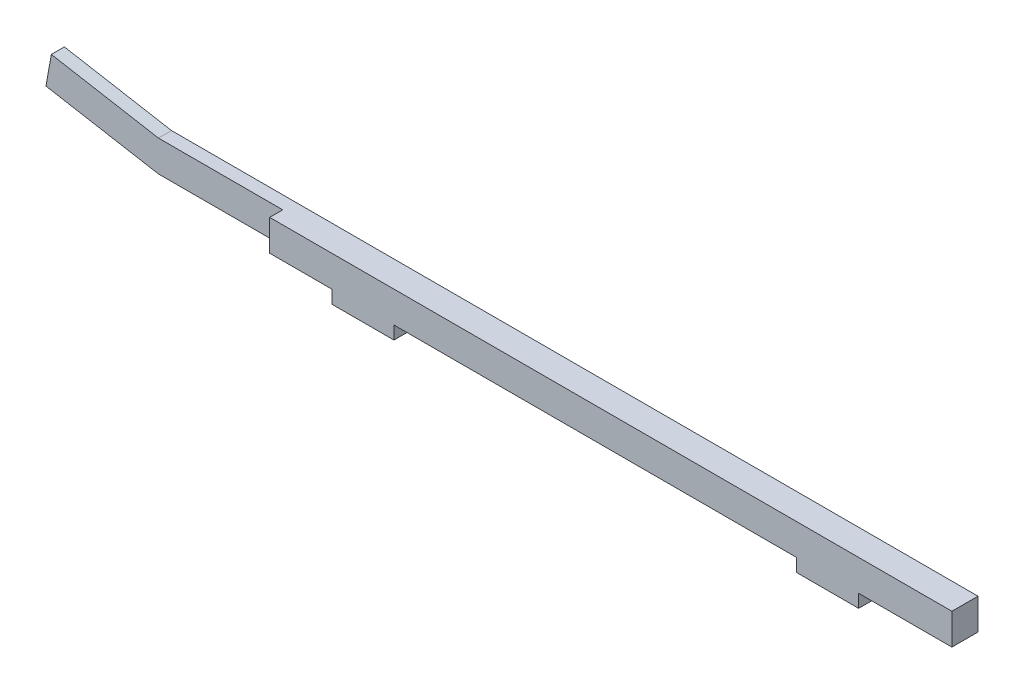
ISO-10303-21;
HEADER;
FILE_DESCRIPTION(('STEP AP214'),'2;1');
FILE_NAME('part.step','',(''),(''),'','','');
FILE_SCHEMA(('AUTOMOTIVE_DESIGN { 1 0 10303 214 1 1 1 1 }'));
ENDSEC;
DATA;
#1=APPLICATION_CONTEXT('core data for automotive mechanical design processes');
#2=APPLICATION_PROTOCOL_DEFINITION('international standard','automotive_design',2000,#1);
#3=PRODUCT_CONTEXT('',#1,'mechanical');
#4=PRODUCT('Part','Part','',(#3));
#5=PRODUCT_RELATED_PRODUCT_CATEGORY('part','',(#4));
#6=PRODUCT_DEFINITION_FORMATION('','',#4);
#7=PRODUCT_DEFINITION_CONTEXT('part definition',#1,'design');
#8=PRODUCT_DEFINITION('design','',#6,#7);
#9=PRODUCT_DEFINITION_SHAPE('','',#8);
#10=(LENGTH_UNIT() NAMED_UNIT(*) SI_UNIT(.MILLI.,.METRE.));
#11=(NAMED_UNIT(*) PLANE_ANGLE_UNIT() SI_UNIT($,.RADIAN.));
#12=(NAMED_UNIT(*) SI_UNIT($,.STERADIAN.) SOLID_ANGLE_UNIT());
#13=UNCERTAINTY_MEASURE_WITH_UNIT(LENGTH_MEASURE(1.E-05),#10,'distance_accuracy_value','');
#14=(GEOMETRIC_REPRESENTATION_CONTEXT(3) GLOBAL_UNCERTAINTY_ASSIGNED_CONTEXT((#13)) GLOBAL_UNIT_ASSIGNED_CONTEXT((#10,
#11,#12)) REPRESENTATION_CONTEXT('',''));
#15=CARTESIAN_POINT('',(0.,0.,0.));
#16=DIRECTION('',(0.,0.,1.));
#17=DIRECTION('',(1.,0.,0.));
#18=AXIS2_PLACEMENT_3D('',#15,#16,#17);
#19=CARTESIAN_POINT('',(0.,5.334,0.));
#20=DIRECTION('',(0.,1.,0.));
#21=DIRECTION('',(0.,0.,1.));
#22=AXIS2_PLACEMENT_3D('',#19,#20,#21);
#23=PLANE('',#22);
#24=DIRECTION('',(0.,0.,1.));
#25=VECTOR('',#24,1.);
#26=CARTESIAN_POINT('',(291.517035207962,5.334,0.));
#27=LINE('',#26,#25);
#28=CARTESIAN_POINT('',(291.517035207962,5.334,54.6115268567689));
#29=VERTEX_POINT('',#28);
#30=CARTESIAN_POINT('',(291.517035207962,5.334,65.2795268567689));
#31=VERTEX_POINT('',#30);
#32=EDGE_CURVE('E225',#29,#31,#27,.T.);
#33=ORIENTED_EDGE('',*,*,#32,.F.);
#34=DIRECTION('',(-1.,0.,0.));
#35=VECTOR('',#34,1.);
#36=CARTESIAN_POINT('',(0.,5.334,54.6115268567689));
#37=LINE('',#36,#35);
#38=CARTESIAN_POINT('',(329.617035207962,5.334,54.6115268567689));
#39=VERTEX_POINT('',#38);
#40=EDGE_CURVE('E198',#39,#29,#37,.T.);
#41=ORIENTED_EDGE('',*,*,#40,.F.);
#42=DIRECTION('',(0.,0.,1.));
#43=VECTOR('',#42,1.);
#44=CARTESIAN_POINT('',(329.617035207962,5.334,54.6115268567689));
#45=LINE('',#44,#43);
#46=CARTESIAN_POINT('',(329.617035207962,5.334,65.2795268567689));
#47=VERTEX_POINT('',#46);
#48=EDGE_CURVE('E237',#39,#47,#45,.T.);
#49=ORIENTED_EDGE('',*,*,#48,.T.);
#50=DIRECTION('',(-1.,0.,0.));
#51=VECTOR('',#50,1.);
#52=CARTESIAN_POINT('',(0.,5.334,65.2795268567689));
#53=LINE('',#52,#51);
#54=EDGE_CURVE('E86',#47,#31,#53,.T.);
#55=ORIENTED_EDGE('',*,*,#54,.T.);
#56=EDGE_LOOP('',(#33,#41,#49,#55));
#57=FACE_BOUND('',#56,.T.);
#58=ADVANCED_FACE('F61',(#57),#23,.F.);
#59=DIRECTION('',(0.,0.,-1.));
#60=VECTOR('',#59,1.);
#61=CARTESIAN_POINT('',(266.117035207962,5.334,1.38474531183382E-12));
#62=LINE('',#61,#60);
#63=CARTESIAN_POINT('',(266.117035207962,5.334,65.2795268567689));
#64=VERTEX_POINT('',#63);
#65=CARTESIAN_POINT('',(266.117035207962,5.334,54.6115268567689));
#66=VERTEX_POINT('',#65);
#67=EDGE_CURVE('E78',#64,#66,#62,.T.);
#68=ORIENTED_EDGE('',*,*,#67,.F.);
#69=CARTESIAN_POINT('',(101.599999999999,5.334,65.2795268567689));
#70=VERTEX_POINT('',#69);
#71=EDGE_CURVE('E256',#64,#70,#53,.T.);
#72=ORIENTED_EDGE('',*,*,#71,.T.);
#73=DIRECTION('',(0.,0.,1.));
#74=VECTOR('',#73,1.);
#75=CARTESIAN_POINT('',(101.599999999999,5.334,0.));
#76=LINE('',#75,#74);
#77=CARTESIAN_POINT('',(101.599999999999,5.334,54.6115268567689));
#78=VERTEX_POINT('',#77);
#79=EDGE_CURVE('E275',#78,#70,#76,.T.);
#80=ORIENTED_EDGE('',*,*,#79,.F.);
#81=EDGE_CURVE('E259',#66,#78,#37,.T.);
#82=ORIENTED_EDGE('',*,*,#81,.F.);
#83=EDGE_LOOP('',(#68,#72,#80,#82));
#84=FACE_BOUND('',#83,.T.);
#85=ADVANCED_FACE('F303',(#84),#23,.F.);
#86=CARTESIAN_POINT('',(0.,0.,54.6115268567689));
#87=DIRECTION('',(0.,0.,1.));
#88=DIRECTION('',(1.,0.,0.));
#89=AXIS2_PLACEMENT_3D('',#86,#87,#88);
#90=PLANE('',#89);
#91=DIRECTION('',(0.,1.,0.));
#92=VECTOR('',#91,1.);
#93=CARTESIAN_POINT('',(76.1999999999993,0.,54.6115268567689));
#94=LINE('',#93,#92);
#95=CARTESIAN_POINT('',(76.1999999999993,0.,54.6115268567689));
#96=VERTEX_POINT('',#95);
#97=CARTESIAN_POINT('',(76.1999999999993,5.334,54.6115268567689));
#98=VERTEX_POINT('',#97);
#99=EDGE_CURVE('E65',#96,#98,#94,.T.);
#100=ORIENTED_EDGE('',*,*,#99,.T.);
#101=CARTESIAN_POINT('',(0.,5.334,54.6115268567689));
#102=VERTEX_POINT('',#101);
#103=EDGE_CURVE('E255',#98,#102,#37,.T.);
#104=ORIENTED_EDGE('',*,*,#103,.T.);
#105=DIRECTION('',(-0.984807753012208,0.173648177666931,0.));
#106=VECTOR('',#105,1.);
#107=CARTESIAN_POINT('',(0.912167722249563,5.17316021963601,54.6115268567689));
#108=LINE('',#107,#106);
#109=CARTESIAN_POINT('',(-45.9465325315106,13.4356133553046,54.6115268567689));
#110=VERTEX_POINT('',#109);
#111=EDGE_CURVE('E196',#102,#110,#108,.T.);
#112=ORIENTED_EDGE('',*,*,#111,.T.);
#113=DIRECTION('',(0.173648177666931,0.984807753012208,0.));
#114=VECTOR('',#113,1.);
#115=CARTESIAN_POINT('',(-46.8587002537602,8.26245313566857,54.6115268567689));
#116=LINE('',#115,#114);
#117=CARTESIAN_POINT('',(-43.7747046213926,25.7526614972951,54.6115268567689));
#118=VERTEX_POINT('',#117);
#119=EDGE_CURVE('E207',#110,#118,#116,.T.);
#120=ORIENTED_EDGE('',*,*,#119,.T.);
#121=DIRECTION('',(-0.984807753012208,0.173648177666931,0.));
#122=VECTOR('',#121,1.);
#123=CARTESIAN_POINT('',(3.08399563236757,17.4902083616265,54.6115268567689));
#124=LINE('',#123,#122);
#125=CARTESIAN_POINT('',(0.,18.034,54.6115268567689));
#126=VERTEX_POINT('',#125);
#127=EDGE_CURVE('E211',#126,#118,#124,.T.);
#128=ORIENTED_EDGE('',*,*,#127,.F.);
#129=DIRECTION('',(-1.,0.,0.));
#130=VECTOR('',#129,1.);
#131=CARTESIAN_POINT('',(0.,18.034,54.6115268567689));
#132=LINE('',#131,#130);
#133=CARTESIAN_POINT('',(329.617035207962,18.034,54.6115268567689));
#134=VERTEX_POINT('',#133);
#135=EDGE_CURVE('E248',#134,#126,#132,.T.);
#136=ORIENTED_EDGE('',*,*,#135,.F.);
#137=DIRECTION('',(0.,-1.,0.));
#138=VECTOR('',#137,1.);
#139=CARTESIAN_POINT('',(329.617035207962,18.034,54.6115268567689));
#140=LINE('',#139,#138);
#141=EDGE_CURVE('E266',#134,#39,#140,.T.);
#142=ORIENTED_EDGE('',*,*,#141,.T.);
#143=ORIENTED_EDGE('',*,*,#40,.T.);
#144=DIRECTION('',(0.,1.,0.));
#145=VECTOR('',#144,1.);
#146=CARTESIAN_POINT('',(291.517035207962,0.,54.6115268567689));
#147=LINE('',#146,#145);
#148=CARTESIAN_POINT('',(291.517035207962,0.,54.6115268567689));
#149=VERTEX_POINT('',#148);
#150=EDGE_CURVE('E234',#149,#29,#147,.T.);
#151=ORIENTED_EDGE('',*,*,#150,.F.);
#152=DIRECTION('',(1.,0.,0.));
#153=VECTOR('',#152,1.);
#154=CARTESIAN_POINT('',(0.,0.,54.6115268567689));
#155=LINE('',#154,#153);
#156=CARTESIAN_POINT('',(266.117035207962,0.,54.6115268567689));
#157=VERTEX_POINT('',#156);
#158=EDGE_CURVE('E221',#157,#149,#155,.T.);
#159=ORIENTED_EDGE('',*,*,#158,.F.);
#160=DIRECTION('',(0.,1.,0.));
#161=VECTOR('',#160,1.);
#162=CARTESIAN_POINT('',(266.117035207962,0.,54.6115268567689));
#163=LINE('',#162,#161);
#164=EDGE_CURVE('E231',#157,#66,#163,.T.);
#165=ORIENTED_EDGE('',*,*,#164,.T.);
#166=ORIENTED_EDGE('',*,*,#81,.T.);
#167=DIRECTION('',(0.,1.,0.));
#168=VECTOR('',#167,1.);
#169=CARTESIAN_POINT('',(101.599999999999,0.,54.6115268567689));
#170=LINE('',#169,#168);
#171=CARTESIAN_POINT('',(101.599999999999,0.,54.6115268567689));
#172=VERTEX_POINT('',#171);
#173=EDGE_CURVE('E12',#172,#78,#170,.T.);
#174=ORIENTED_EDGE('',*,*,#173,.F.);
#175=DIRECTION('',(1.,0.,0.));
#176=VECTOR('',#175,1.);
#177=CARTESIAN_POINT('',(0.,0.,54.6115268567689));
#178=LINE('',#177,#176);
#179=EDGE_CURVE('E271',#96,#172,#178,.T.);
#180=ORIENTED_EDGE('',*,*,#179,.F.);
#181=EDGE_LOOP('',(#100,#104,#112,#120,#128,#136,#142,#143,#151,#159,#165,#166,#174,#180));
#182=FACE_BOUND('',#181,.T.);
#183=ADVANCED_FACE('F63',(#182),#90,.F.);
#184=CARTESIAN_POINT('',(101.599999999999,0.,0.));
#185=DIRECTION('',(-1.,0.,0.));
#186=DIRECTION('',(0.,0.,1.));
#187=AXIS2_PLACEMENT_3D('',#184,#185,#186);
#188=PLANE('',#187);
#189=ORIENTED_EDGE('',*,*,#79,.T.);
#190=DIRECTION('',(0.,1.,0.));
#191=VECTOR('',#190,1.);
#192=CARTESIAN_POINT('',(101.599999999999,0.,65.2795268567689));
#193=LINE('',#192,#191);
#194=CARTESIAN_POINT('',(101.599999999999,0.,65.2795268567689));
#195=VERTEX_POINT('',#194);
#196=EDGE_CURVE('E70',#195,#70,#193,.T.);
#197=ORIENTED_EDGE('',*,*,#196,.F.);
#198=DIRECTION('',(0.,0.,1.));
#199=VECTOR('',#198,1.);
#200=CARTESIAN_POINT('',(101.599999999999,0.,0.));
#201=LINE('',#200,#199);
#202=EDGE_CURVE('E279',#172,#195,#201,.T.);
#203=ORIENTED_EDGE('',*,*,#202,.F.);
#204=ORIENTED_EDGE('',*,*,#173,.T.);
#205=EDGE_LOOP('',(#189,#197,#203,#204));
#206=FACE_BOUND('',#205,.T.);
#207=ADVANCED_FACE('F307',(#206),#188,.F.);
#208=CARTESIAN_POINT('',(0.,0.,65.2795268567689));
#209=DIRECTION('',(0.,0.,-1.));
#210=DIRECTION('',(-1.,0.,0.));
#211=AXIS2_PLACEMENT_3D('',#208,#209,#210);
#212=PLANE('',#211);
#213=DIRECTION('',(-1.,0.,0.));
#214=VECTOR('',#213,1.);
#215=CARTESIAN_POINT('',(0.,18.034,65.2795268567689));
#216=LINE('',#215,#214);
#217=CARTESIAN_POINT('',(329.617035207962,18.034,65.2795268567689));
#218=VERTEX_POINT('',#217);
#219=CARTESIAN_POINT('',(50.8,18.034,65.2795268567689));
#220=VERTEX_POINT('',#219);
#221=EDGE_CURVE('E197',#218,#220,#216,.T.);
#222=ORIENTED_EDGE('',*,*,#221,.T.);
#223=DIRECTION('',(0.,1.,0.));
#224=VECTOR('',#223,1.);
#225=CARTESIAN_POINT('',(50.8,18.034,65.2795268567689));
#226=LINE('',#225,#224);
#227=CARTESIAN_POINT('',(50.8,5.334,65.2795268567689));
#228=VERTEX_POINT('',#227);
#229=EDGE_CURVE('E188',#228,#220,#226,.T.);
#230=ORIENTED_EDGE('',*,*,#229,.F.);
#231=CARTESIAN_POINT('',(76.1999999999993,5.334,65.2795268567689));
#232=VERTEX_POINT('',#231);
#233=EDGE_CURVE('E257',#232,#228,#53,.T.);
#234=ORIENTED_EDGE('',*,*,#233,.F.);
#235=DIRECTION('',(0.,1.,0.));
#236=VECTOR('',#235,1.);
#237=CARTESIAN_POINT('',(76.1999999999993,0.,65.2795268567689));
#238=LINE('',#237,#236);
#239=CARTESIAN_POINT('',(76.1999999999993,0.,65.2795268567689));
#240=VERTEX_POINT('',#239);
#241=EDGE_CURVE('E286',#240,#232,#238,.T.);
#242=ORIENTED_EDGE('',*,*,#241,.F.);
#243=DIRECTION('',(-1.,0.,0.));
#244=VECTOR('',#243,1.);
#245=CARTESIAN_POINT('',(0.,0.,65.2795268567689));
#246=LINE('',#245,#244);
#247=EDGE_CURVE('E277',#195,#240,#246,.T.);
#248=ORIENTED_EDGE('',*,*,#247,.F.);
#249=ORIENTED_EDGE('',*,*,#196,.T.);
#250=ORIENTED_EDGE('',*,*,#71,.F.);
#251=DIRECTION('',(0.,1.,0.));
#252=VECTOR('',#251,1.);
#253=CARTESIAN_POINT('',(266.117035207962,0.,65.2795268567689));
#254=LINE('',#253,#252);
#255=CARTESIAN_POINT('',(266.117035207962,0.,65.2795268567689));
#256=VERTEX_POINT('',#255);
#257=EDGE_CURVE('E241',#256,#64,#254,.T.);
#258=ORIENTED_EDGE('',*,*,#257,.F.);
#259=DIRECTION('',(-1.,0.,0.));
#260=VECTOR('',#259,1.);
#261=CARTESIAN_POINT('',(0.,0.,65.2795268567689));
#262=LINE('',#261,#260);
#263=CARTESIAN_POINT('',(291.517035207962,0.,65.2795268567689));
#264=VERTEX_POINT('',#263);
#265=EDGE_CURVE('E227',#264,#256,#262,.T.);
#266=ORIENTED_EDGE('',*,*,#265,.F.);
#267=DIRECTION('',(0.,1.,0.));
#268=VECTOR('',#267,1.);
#269=CARTESIAN_POINT('',(291.517035207962,0.,65.2795268567689));
#270=LINE('',#269,#268);
#271=EDGE_CURVE('E238',#264,#31,#270,.T.);
#272=ORIENTED_EDGE('',*,*,#271,.T.);
#273=ORIENTED_EDGE('',*,*,#54,.F.);
#274=DIRECTION('',(0.,-1.,0.));
#275=VECTOR('',#274,1.);
#276=CARTESIAN_POINT('',(329.617035207962,18.034,65.2795268567689));
#277=LINE('',#276,#275);
#278=EDGE_CURVE('E264',#218,#47,#277,.T.);
#279=ORIENTED_EDGE('',*,*,#278,.F.);
#280=EDGE_LOOP('',(#222,#230,#234,#242,#248,#249,#250,#258,#266,#272,#273,#279));
#281=FACE_BOUND('',#280,.T.);
#282=ADVANCED_FACE('F300',(#281),#212,.F.);
#283=CARTESIAN_POINT('',(76.1999999999994,0.,0.));
#284=DIRECTION('',(1.,0.,0.));
#285=DIRECTION('',(0.,0.,-1.));
#286=AXIS2_PLACEMENT_3D('',#283,#284,#285);
#287=PLANE('',#286);
#288=DIRECTION('',(0.,0.,-1.));
#289=VECTOR('',#288,1.);
#290=CARTESIAN_POINT('',(76.1999999999994,5.334,0.));
#291=LINE('',#290,#289);
#292=EDGE_CURVE('E253',#232,#98,#291,.T.);
#293=ORIENTED_EDGE('',*,*,#292,.T.);
#294=ORIENTED_EDGE('',*,*,#99,.F.);
#295=DIRECTION('',(0.,0.,-1.));
#296=VECTOR('',#295,1.);
#297=CARTESIAN_POINT('',(76.1999999999994,0.,0.));
#298=LINE('',#297,#296);
#299=EDGE_CURVE('E274',#240,#96,#298,.T.);
#300=ORIENTED_EDGE('',*,*,#299,.F.);
#301=ORIENTED_EDGE('',*,*,#241,.T.);
#302=EDGE_LOOP('',(#293,#294,#300,#301));
#303=FACE_BOUND('',#302,.T.);
#304=ADVANCED_FACE('F296',(#303),#287,.F.);
#305=CARTESIAN_POINT('',(0.,0.,0.));
#306=DIRECTION('',(0.,1.,0.));
#307=DIRECTION('',(0.,0.,1.));
#308=AXIS2_PLACEMENT_3D('',#305,#306,#307);
#309=PLANE('',#308);
#310=ORIENTED_EDGE('',*,*,#179,.T.);
#311=ORIENTED_EDGE('',*,*,#202,.T.);
#312=ORIENTED_EDGE('',*,*,#247,.T.);
#313=ORIENTED_EDGE('',*,*,#299,.T.);
#314=EDGE_LOOP('',(#310,#311,#312,#313));
#315=FACE_BOUND('',#314,.T.);
#316=ADVANCED_FACE('F309',(#315),#309,.F.);
#317=ORIENTED_EDGE('',*,*,#233,.T.);
#318=DIRECTION('',(0.,0.,1.));
#319=VECTOR('',#318,1.);
#320=CARTESIAN_POINT('',(50.8,5.334,59.9455268567689));
#321=LINE('',#320,#319);
#322=CARTESIAN_POINT('',(50.8,5.334,59.9455268567689));
#323=VERTEX_POINT('',#322);
#324=EDGE_CURVE('E183',#323,#228,#321,.T.);
#325=ORIENTED_EDGE('',*,*,#324,.F.);
#326=DIRECTION('',(1.,0.,0.));
#327=VECTOR('',#326,1.);
#328=CARTESIAN_POINT('',(0.,5.334,59.9455268567689));
#329=LINE('',#328,#327);
#330=CARTESIAN_POINT('',(0.,5.334,59.9455268567689));
#331=VERTEX_POINT('',#330);
#332=EDGE_CURVE('E177',#331,#323,#329,.T.);
#333=ORIENTED_EDGE('',*,*,#332,.F.);
#334=DIRECTION('',(0.,0.,1.));
#335=VECTOR('',#334,1.);
#336=CARTESIAN_POINT('',(0.,5.334,0.));
#337=LINE('',#336,#335);
#338=EDGE_CURVE('E181',#102,#331,#337,.T.);
#339=ORIENTED_EDGE('',*,*,#338,.F.);
#340=ORIENTED_EDGE('',*,*,#103,.F.);
#341=ORIENTED_EDGE('',*,*,#292,.F.);
#342=EDGE_LOOP('',(#317,#325,#333,#339,#340,#341));
#343=FACE_BOUND('',#342,.T.);
#344=ADVANCED_FACE('F180',(#343),#23,.F.);
#345=CARTESIAN_POINT('',(0.,18.034,0.));
#346=DIRECTION('',(0.,1.,0.));
#347=DIRECTION('',(0.,0.,1.));
#348=AXIS2_PLACEMENT_3D('',#345,#346,#347);
#349=PLANE('',#348);
#350=DIRECTION('',(0.,0.,1.));
#351=VECTOR('',#350,1.);
#352=CARTESIAN_POINT('',(50.8,18.034,59.9455268567689));
#353=LINE('',#352,#351);
#354=CARTESIAN_POINT('',(50.8,18.034,59.9455268567689));
#355=VERTEX_POINT('',#354);
#356=EDGE_CURVE('E214',#355,#220,#353,.T.);
#357=ORIENTED_EDGE('',*,*,#356,.T.);
#358=ORIENTED_EDGE('',*,*,#221,.F.);
#359=DIRECTION('',(0.,0.,1.));
#360=VECTOR('',#359,1.);
#361=CARTESIAN_POINT('',(329.617035207962,18.034,54.6115268567689));
#362=LINE('',#361,#360);
#363=EDGE_CURVE('E261',#134,#218,#362,.T.);
#364=ORIENTED_EDGE('',*,*,#363,.F.);
#365=ORIENTED_EDGE('',*,*,#135,.T.);
#366=DIRECTION('',(0.,0.,1.));
#367=VECTOR('',#366,1.);
#368=CARTESIAN_POINT('',(0.,18.034,0.));
#369=LINE('',#368,#367);
#370=CARTESIAN_POINT('',(0.,18.034,59.9455268567689));
#371=VERTEX_POINT('',#370);
#372=EDGE_CURVE('E250',#126,#371,#369,.T.);
#373=ORIENTED_EDGE('',*,*,#372,.T.);
#374=DIRECTION('',(-1.,0.,0.));
#375=VECTOR('',#374,1.);
#376=CARTESIAN_POINT('',(0.,18.034,59.9455268567689));
#377=LINE('',#376,#375);
#378=EDGE_CURVE('E333',#355,#371,#377,.T.);
#379=ORIENTED_EDGE('',*,*,#378,.F.);
#380=EDGE_LOOP('',(#357,#358,#364,#365,#373,#379));
#381=FACE_BOUND('',#380,.T.);
#382=ADVANCED_FACE('F331',(#381),#349,.T.);
#383=CARTESIAN_POINT('',(329.617035207962,18.034,54.6115268567689));
#384=DIRECTION('',(1.,0.,0.));
#385=DIRECTION('',(0.,0.,-1.));
#386=AXIS2_PLACEMENT_3D('',#383,#384,#385);
#387=PLANE('',#386);
#388=ORIENTED_EDGE('',*,*,#48,.F.);
#389=ORIENTED_EDGE('',*,*,#141,.F.);
#390=ORIENTED_EDGE('',*,*,#363,.T.);
#391=ORIENTED_EDGE('',*,*,#278,.T.);
#392=EDGE_LOOP('',(#388,#389,#390,#391));
#393=FACE_BOUND('',#392,.T.);
#394=ADVANCED_FACE('F327',(#393),#387,.T.);
#395=CARTESIAN_POINT('',(291.517035207962,0.,0.));
#396=DIRECTION('',(-1.,0.,0.));
#397=DIRECTION('',(0.,0.,1.));
#398=AXIS2_PLACEMENT_3D('',#395,#396,#397);
#399=PLANE('',#398);
#400=ORIENTED_EDGE('',*,*,#32,.T.);
#401=ORIENTED_EDGE('',*,*,#271,.F.);
#402=DIRECTION('',(0.,0.,1.));
#403=VECTOR('',#402,1.);
#404=CARTESIAN_POINT('',(291.517035207962,0.,0.));
#405=LINE('',#404,#403);
#406=EDGE_CURVE('E229',#149,#264,#405,.T.);
#407=ORIENTED_EDGE('',*,*,#406,.F.);
#408=ORIENTED_EDGE('',*,*,#150,.T.);
#409=EDGE_LOOP('',(#400,#401,#407,#408));
#410=FACE_BOUND('',#409,.T.);
#411=ADVANCED_FACE('F321',(#410),#399,.F.);
#412=CARTESIAN_POINT('',(266.117035207962,0.,1.38474531183382E-12));
#413=DIRECTION('',(1.,0.,0.));
#414=DIRECTION('',(0.,0.,-1.));
#415=AXIS2_PLACEMENT_3D('',#412,#413,#414);
#416=PLANE('',#415);
#417=ORIENTED_EDGE('',*,*,#67,.T.);
#418=ORIENTED_EDGE('',*,*,#164,.F.);
#419=DIRECTION('',(0.,0.,-1.));
#420=VECTOR('',#419,1.);
#421=CARTESIAN_POINT('',(266.117035207962,0.,1.38474531183382E-12));
#422=LINE('',#421,#420);
#423=EDGE_CURVE('E224',#256,#157,#422,.T.);
#424=ORIENTED_EDGE('',*,*,#423,.F.);
#425=ORIENTED_EDGE('',*,*,#257,.T.);
#426=EDGE_LOOP('',(#417,#418,#424,#425));
#427=FACE_BOUND('',#426,.T.);
#428=ADVANCED_FACE('F313',(#427),#416,.F.);
#429=CARTESIAN_POINT('',(0.,0.,0.));
#430=DIRECTION('',(0.,1.,0.));
#431=DIRECTION('',(0.,0.,1.));
#432=AXIS2_PLACEMENT_3D('',#429,#430,#431);
#433=PLANE('',#432);
#434=ORIENTED_EDGE('',*,*,#158,.T.);
#435=ORIENTED_EDGE('',*,*,#406,.T.);
#436=ORIENTED_EDGE('',*,*,#265,.T.);
#437=ORIENTED_EDGE('',*,*,#423,.T.);
#438=EDGE_LOOP('',(#434,#435,#436,#437));
#439=FACE_BOUND('',#438,.T.);
#440=ADVANCED_FACE('F318',(#439),#433,.F.);
#441=CARTESIAN_POINT('',(3.08399563236757,17.4902083616265,59.9455268567689));
#442=DIRECTION('',(-0.173648177666931,-0.984807753012208,0.));
#443=DIRECTION('',(0.984807753012208,-0.173648177666931,0.));
#444=AXIS2_PLACEMENT_3D('',#441,#442,#443);
#445=PLANE('',#444);
#446=ORIENTED_EDGE('',*,*,#127,.T.);
#447=DIRECTION('',(0.,0.,-1.));
#448=VECTOR('',#447,1.);
#449=CARTESIAN_POINT('',(-43.7747046213926,25.7526614972951,59.9455268567689));
#450=LINE('',#449,#448);
#451=CARTESIAN_POINT('',(-43.7747046213926,25.7526614972951,59.9455268567689));
#452=VERTEX_POINT('',#451);
#453=EDGE_CURVE('E218',#452,#118,#450,.T.);
#454=ORIENTED_EDGE('',*,*,#453,.F.);
#455=DIRECTION('',(-0.984807753012208,0.173648177666931,0.));
#456=VECTOR('',#455,1.);
#457=CARTESIAN_POINT('',(3.08399563236757,17.4902083616265,59.9455268567689));
#458=LINE('',#457,#456);
#459=EDGE_CURVE('E203',#371,#452,#458,.T.);
#460=ORIENTED_EDGE('',*,*,#459,.F.);
#461=ORIENTED_EDGE('',*,*,#372,.F.);
#462=EDGE_LOOP('',(#446,#454,#460,#461));
#463=FACE_BOUND('',#462,.T.);
#464=ADVANCED_FACE('F417',(#463),#445,.F.);
#465=CARTESIAN_POINT('',(-46.8587002537602,8.26245313566857,59.9455268567689));
#466=DIRECTION('',(-0.984807753012208,0.173648177666931,0.));
#467=DIRECTION('',(-0.173648177666931,-0.984807753012208,0.));
#468=AXIS2_PLACEMENT_3D('',#465,#466,#467);
#469=PLANE('',#468);
#470=ORIENTED_EDGE('',*,*,#119,.F.);
#471=DIRECTION('',(0.,0.,-1.));
#472=VECTOR('',#471,1.);
#473=CARTESIAN_POINT('',(-45.9465325315106,13.4356133553046,59.9455268567689));
#474=LINE('',#473,#472);
#475=CARTESIAN_POINT('',(-45.9465325315106,13.4356133553046,59.9455268567689));
#476=VERTEX_POINT('',#475);
#477=EDGE_CURVE('E205',#476,#110,#474,.T.);
#478=ORIENTED_EDGE('',*,*,#477,.F.);
#479=DIRECTION('',(0.173648177666931,0.984807753012208,0.));
#480=VECTOR('',#479,1.);
#481=CARTESIAN_POINT('',(-46.8587002537602,8.26245313566857,59.9455268567689));
#482=LINE('',#481,#480);
#483=EDGE_CURVE('E202',#476,#452,#482,.T.);
#484=ORIENTED_EDGE('',*,*,#483,.T.);
#485=ORIENTED_EDGE('',*,*,#453,.T.);
#486=EDGE_LOOP('',(#470,#478,#484,#485));
#487=FACE_BOUND('',#486,.T.);
#488=ADVANCED_FACE('F430',(#487),#469,.T.);
#489=CARTESIAN_POINT('',(0.912167722249563,5.17316021963601,59.9455268567689));
#490=DIRECTION('',(-0.173648177666931,-0.984807753012208,0.));
#491=DIRECTION('',(0.984807753012208,-0.173648177666931,0.));
#492=AXIS2_PLACEMENT_3D('',#489,#490,#491);
#493=PLANE('',#492);
#494=ORIENTED_EDGE('',*,*,#111,.F.);
#495=ORIENTED_EDGE('',*,*,#338,.T.);
#496=DIRECTION('',(-0.984807753012208,0.173648177666931,0.));
#497=VECTOR('',#496,1.);
#498=CARTESIAN_POINT('',(0.912167722249563,5.17316021963601,59.9455268567689));
#499=LINE('',#498,#497);
#500=EDGE_CURVE('E193',#331,#476,#499,.T.);
#501=ORIENTED_EDGE('',*,*,#500,.T.);
#502=ORIENTED_EDGE('',*,*,#477,.T.);
#503=EDGE_LOOP('',(#494,#495,#501,#502));
#504=FACE_BOUND('',#503,.T.);
#505=ADVANCED_FACE('F192',(#504),#493,.T.);
#506=CARTESIAN_POINT('',(0.,0.,59.9455268567689));
#507=DIRECTION('',(0.,0.,-1.));
#508=DIRECTION('',(-1.,0.,0.));
#509=AXIS2_PLACEMENT_3D('',#506,#507,#508);
#510=PLANE('',#509);
#511=ORIENTED_EDGE('',*,*,#459,.T.);
#512=ORIENTED_EDGE('',*,*,#483,.F.);
#513=ORIENTED_EDGE('',*,*,#500,.F.);
#514=ORIENTED_EDGE('',*,*,#332,.T.);
#515=DIRECTION('',(0.,1.,0.));
#516=VECTOR('',#515,1.);
#517=CARTESIAN_POINT('',(50.8,18.034,59.9455268567689));
#518=LINE('',#517,#516);
#519=EDGE_CURVE('E187',#323,#355,#518,.T.);
#520=ORIENTED_EDGE('',*,*,#519,.T.);
#521=ORIENTED_EDGE('',*,*,#378,.T.);
#522=EDGE_LOOP('',(#511,#512,#513,#514,#520,#521));
#523=FACE_BOUND('',#522,.T.);
#524=ADVANCED_FACE('F200',(#523),#510,.F.);
#525=CARTESIAN_POINT('',(50.8,18.034,59.9455268567689));
#526=DIRECTION('',(1.,0.,0.));
#527=DIRECTION('',(0.,0.,-1.));
#528=AXIS2_PLACEMENT_3D('',#525,#526,#527);
#529=PLANE('',#528);
#530=ORIENTED_EDGE('',*,*,#229,.T.);
#531=ORIENTED_EDGE('',*,*,#356,.F.);
#532=ORIENTED_EDGE('',*,*,#519,.F.);
#533=ORIENTED_EDGE('',*,*,#324,.T.);
#534=EDGE_LOOP('',(#530,#531,#532,#533));
#535=FACE_BOUND('',#534,.T.);
#536=ADVANCED_FACE('F339',(#535),#529,.F.);
#537=CLOSED_SHELL('',(#58,#85,#183,#207,#282,#304,#316,#344,#382,#394,#411,#428,#440,#464,#488,
#505,#524,#536));
#538=MANIFOLD_SOLID_BREP('B2',#537);
#539=ADVANCED_BREP_SHAPE_REPRESENTATION('',(#18,#538),#14);
#540=SHAPE_DEFINITION_REPRESENTATION(#9,#539);
ENDSEC;
END-ISO-10303-21;
